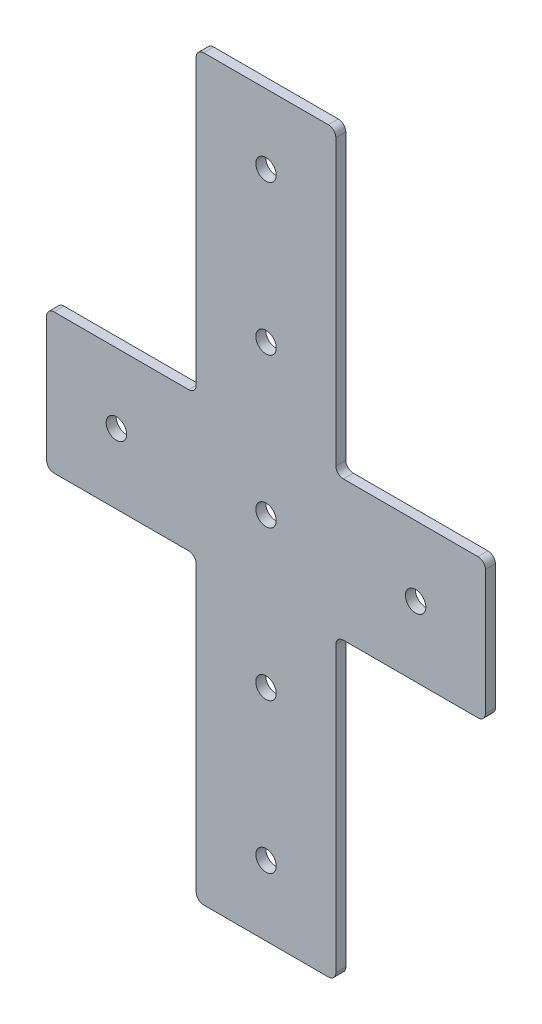
ISO-10303-21;
HEADER;
FILE_DESCRIPTION(('STEP AP214'),'2;1');
FILE_NAME('part.step','',(''),(''),'','','');
FILE_SCHEMA(('AUTOMOTIVE_DESIGN { 1 0 10303 214 1 1 1 1 }'));
ENDSEC;
DATA;
#1=APPLICATION_CONTEXT('core data for automotive mechanical design processes');
#2=APPLICATION_PROTOCOL_DEFINITION('international standard','automotive_design',2000,#1);
#3=PRODUCT_CONTEXT('',#1,'mechanical');
#4=PRODUCT('Part','Part','',(#3));
#5=PRODUCT_RELATED_PRODUCT_CATEGORY('part','',(#4));
#6=PRODUCT_DEFINITION_FORMATION('','',#4);
#7=PRODUCT_DEFINITION_CONTEXT('part definition',#1,'design');
#8=PRODUCT_DEFINITION('design','',#6,#7);
#9=PRODUCT_DEFINITION_SHAPE('','',#8);
#10=(LENGTH_UNIT() NAMED_UNIT(*) SI_UNIT(.MILLI.,.METRE.));
#11=(NAMED_UNIT(*) PLANE_ANGLE_UNIT() SI_UNIT($,.RADIAN.));
#12=(NAMED_UNIT(*) SI_UNIT($,.STERADIAN.) SOLID_ANGLE_UNIT());
#13=UNCERTAINTY_MEASURE_WITH_UNIT(LENGTH_MEASURE(1.E-05),#10,'distance_accuracy_value','');
#14=(GEOMETRIC_REPRESENTATION_CONTEXT(3) GLOBAL_UNCERTAINTY_ASSIGNED_CONTEXT((#13)) GLOBAL_UNIT_ASSIGNED_CONTEXT((#10,
#11,#12)) REPRESENTATION_CONTEXT('',''));
#15=CARTESIAN_POINT('',(0.,0.,0.));
#16=DIRECTION('',(0.,0.,1.));
#17=DIRECTION('',(1.,0.,0.));
#18=AXIS2_PLACEMENT_3D('',#15,#16,#17);
#19=CARTESIAN_POINT('',(148.,28.,4.));
#20=DIRECTION('',(-1.,0.,0.));
#21=DIRECTION('',(0.,0.,1.));
#22=AXIS2_PLACEMENT_3D('',#19,#20,#21);
#23=PLANE('',#22);
#24=DIRECTION('',(0.,1.,0.));
#25=VECTOR('',#24,1.);
#26=CARTESIAN_POINT('',(148.,28.,0.));
#27=LINE('',#26,#25);
#28=CARTESIAN_POINT('',(148.,-25.,0.));
#29=VERTEX_POINT('',#28);
#30=CARTESIAN_POINT('',(148.,25.,0.));
#31=VERTEX_POINT('',#30);
#32=EDGE_CURVE('E253',#29,#31,#27,.T.);
#33=ORIENTED_EDGE('',*,*,#32,.T.);
#34=DIRECTION('',(0.,0.,-1.));
#35=VECTOR('',#34,1.);
#36=CARTESIAN_POINT('',(148.,25.,4.));
#37=LINE('',#36,#35);
#38=CARTESIAN_POINT('',(148.,25.,4.));
#39=VERTEX_POINT('',#38);
#40=EDGE_CURVE('E381',#39,#31,#37,.T.);
#41=ORIENTED_EDGE('',*,*,#40,.F.);
#42=DIRECTION('',(0.,1.,0.));
#43=VECTOR('',#42,1.);
#44=CARTESIAN_POINT('',(148.,28.,4.));
#45=LINE('',#44,#43);
#46=CARTESIAN_POINT('',(148.,-25.,4.));
#47=VERTEX_POINT('',#46);
#48=EDGE_CURVE('E266',#47,#39,#45,.T.);
#49=ORIENTED_EDGE('',*,*,#48,.F.);
#50=DIRECTION('',(0.,0.,-1.));
#51=VECTOR('',#50,1.);
#52=CARTESIAN_POINT('',(148.,-25.,4.));
#53=LINE('',#52,#51);
#54=EDGE_CURVE('E323',#47,#29,#53,.T.);
#55=ORIENTED_EDGE('',*,*,#54,.T.);
#56=EDGE_LOOP('',(#33,#41,#49,#55));
#57=FACE_BOUND('',#56,.T.);
#58=ADVANCED_FACE('F16',(#57),#23,.F.);
#59=CARTESIAN_POINT('',(0.,0.,4.));
#60=DIRECTION('',(0.,0.,1.));
#61=DIRECTION('',(1.,0.,0.));
#62=AXIS2_PLACEMENT_3D('',#59,#60,#61);
#63=PLANE('',#62);
#64=CARTESIAN_POINT('',(60.,0.,4.));
#65=DIRECTION('',(0.,0.,1.));
#66=DIRECTION('',(1.,0.,0.));
#67=AXIS2_PLACEMENT_3D('',#64,#65,#66);
#68=CIRCLE('',#67,4.09999999999999);
#69=CARTESIAN_POINT('',(64.1,0.,4.));
#70=VERTEX_POINT('',#69);
#71=EDGE_CURVE('E238',#70,#70,#68,.T.);
#72=ORIENTED_EDGE('',*,*,#71,.F.);
#73=EDGE_LOOP('',(#72));
#74=FACE_BOUND('',#73,.T.);
#75=CARTESIAN_POINT('',(120.,0.,4.));
#76=DIRECTION('',(0.,0.,1.));
#77=DIRECTION('',(1.,0.,0.));
#78=AXIS2_PLACEMENT_3D('',#75,#76,#77);
#79=CIRCLE('',#78,4.1);
#80=CARTESIAN_POINT('',(124.1,0.,4.));
#81=VERTEX_POINT('',#80);
#82=EDGE_CURVE('E232',#81,#81,#79,.T.);
#83=ORIENTED_EDGE('',*,*,#82,.F.);
#84=EDGE_LOOP('',(#83));
#85=FACE_BOUND('',#84,.T.);
#86=CARTESIAN_POINT('',(0.,0.,4.));
#87=DIRECTION('',(0.,0.,1.));
#88=DIRECTION('',(1.,0.,0.));
#89=AXIS2_PLACEMENT_3D('',#86,#87,#88);
#90=CIRCLE('',#89,4.1);
#91=CARTESIAN_POINT('',(4.1,0.,4.));
#92=VERTEX_POINT('',#91);
#93=EDGE_CURVE('E244',#92,#92,#90,.T.);
#94=ORIENTED_EDGE('',*,*,#93,.F.);
#95=EDGE_LOOP('',(#94));
#96=FACE_BOUND('',#95,.T.);
#97=CARTESIAN_POINT('',(60.0000000000006,-120.,4.));
#98=DIRECTION('',(0.,0.,1.));
#99=DIRECTION('',(1.,0.,0.));
#100=AXIS2_PLACEMENT_3D('',#97,#98,#99);
#101=CIRCLE('',#100,4.1);
#102=CARTESIAN_POINT('',(64.1000000000006,-120.,4.));
#103=VERTEX_POINT('',#102);
#104=EDGE_CURVE('E226',#103,#103,#101,.T.);
#105=ORIENTED_EDGE('',*,*,#104,.F.);
#106=EDGE_LOOP('',(#105));
#107=FACE_BOUND('',#106,.T.);
#108=CARTESIAN_POINT('',(60.,-60.,4.));
#109=DIRECTION('',(0.,0.,1.));
#110=DIRECTION('',(1.,0.,0.));
#111=AXIS2_PLACEMENT_3D('',#108,#109,#110);
#112=CIRCLE('',#111,4.09999999999999);
#113=CARTESIAN_POINT('',(64.1,-60.,4.));
#114=VERTEX_POINT('',#113);
#115=EDGE_CURVE('E220',#114,#114,#112,.T.);
#116=ORIENTED_EDGE('',*,*,#115,.F.);
#117=EDGE_LOOP('',(#116));
#118=FACE_BOUND('',#117,.T.);
#119=ORIENTED_EDGE('',*,*,#48,.T.);
#120=CARTESIAN_POINT('',(145.,25.,4.));
#121=DIRECTION('',(0.,0.,-1.));
#122=DIRECTION('',(1.,0.,0.));
#123=AXIS2_PLACEMENT_3D('',#120,#121,#122);
#124=CIRCLE('',#123,3.);
#125=CARTESIAN_POINT('',(145.,28.,4.));
#126=VERTEX_POINT('',#125);
#127=EDGE_CURVE('E384',#126,#39,#124,.T.);
#128=ORIENTED_EDGE('',*,*,#127,.F.);
#129=DIRECTION('',(1.,0.,0.));
#130=VECTOR('',#129,1.);
#131=CARTESIAN_POINT('',(88.,28.,4.));
#132=LINE('',#131,#130);
#133=CARTESIAN_POINT('',(91.,28.,4.));
#134=VERTEX_POINT('',#133);
#135=EDGE_CURVE('E419',#134,#126,#132,.T.);
#136=ORIENTED_EDGE('',*,*,#135,.F.);
#137=CARTESIAN_POINT('',(91.,31.,4.));
#138=DIRECTION('',(0.,0.,-1.));
#139=DIRECTION('',(1.,0.,0.));
#140=AXIS2_PLACEMENT_3D('',#137,#138,#139);
#141=CIRCLE('',#140,3.);
#142=CARTESIAN_POINT('',(88.,31.,4.));
#143=VERTEX_POINT('',#142);
#144=EDGE_CURVE('E186',#143,#134,#141,.F.);
#145=ORIENTED_EDGE('',*,*,#144,.F.);
#146=DIRECTION('',(0.,-1.,0.));
#147=VECTOR('',#146,1.);
#148=CARTESIAN_POINT('',(88.,28.,4.));
#149=LINE('',#148,#147);
#150=CARTESIAN_POINT('',(88.,145.,4.));
#151=VERTEX_POINT('',#150);
#152=EDGE_CURVE('E414',#151,#143,#149,.T.);
#153=ORIENTED_EDGE('',*,*,#152,.F.);
#154=CARTESIAN_POINT('',(85.,145.,4.));
#155=DIRECTION('',(0.,0.,-1.));
#156=DIRECTION('',(1.,0.,0.));
#157=AXIS2_PLACEMENT_3D('',#154,#155,#156);
#158=CIRCLE('',#157,3.);
#159=CARTESIAN_POINT('',(85.,148.,4.));
#160=VERTEX_POINT('',#159);
#161=EDGE_CURVE('E387',#160,#151,#158,.T.);
#162=ORIENTED_EDGE('',*,*,#161,.F.);
#163=DIRECTION('',(1.,0.,0.));
#164=VECTOR('',#163,1.);
#165=CARTESIAN_POINT('',(32.,148.,4.));
#166=LINE('',#165,#164);
#167=CARTESIAN_POINT('',(35.,148.,4.));
#168=VERTEX_POINT('',#167);
#169=EDGE_CURVE('E411',#168,#160,#166,.T.);
#170=ORIENTED_EDGE('',*,*,#169,.F.);
#171=CARTESIAN_POINT('',(35.,145.,4.));
#172=DIRECTION('',(0.,0.,-1.));
#173=DIRECTION('',(1.,0.,0.));
#174=AXIS2_PLACEMENT_3D('',#171,#172,#173);
#175=CIRCLE('',#174,3.);
#176=CARTESIAN_POINT('',(32.,145.,4.));
#177=VERTEX_POINT('',#176);
#178=EDGE_CURVE('E391',#177,#168,#175,.T.);
#179=ORIENTED_EDGE('',*,*,#178,.F.);
#180=DIRECTION('',(0.,1.,0.));
#181=VECTOR('',#180,1.);
#182=CARTESIAN_POINT('',(32.,28.,4.));
#183=LINE('',#182,#181);
#184=CARTESIAN_POINT('',(32.,31.,4.));
#185=VERTEX_POINT('',#184);
#186=EDGE_CURVE('E415',#185,#177,#183,.T.);
#187=ORIENTED_EDGE('',*,*,#186,.F.);
#188=CARTESIAN_POINT('',(29.,31.,4.));
#189=DIRECTION('',(0.,0.,-1.));
#190=DIRECTION('',(1.,0.,0.));
#191=AXIS2_PLACEMENT_3D('',#188,#189,#190);
#192=CIRCLE('',#191,3.);
#193=CARTESIAN_POINT('',(29.,28.,4.));
#194=VERTEX_POINT('',#193);
#195=EDGE_CURVE('E216',#194,#185,#192,.F.);
#196=ORIENTED_EDGE('',*,*,#195,.F.);
#197=DIRECTION('',(1.,0.,0.));
#198=VECTOR('',#197,1.);
#199=CARTESIAN_POINT('',(-28.,28.,4.));
#200=LINE('',#199,#198);
#201=CARTESIAN_POINT('',(-25.,28.,4.));
#202=VERTEX_POINT('',#201);
#203=EDGE_CURVE('E199',#202,#194,#200,.T.);
#204=ORIENTED_EDGE('',*,*,#203,.F.);
#205=CARTESIAN_POINT('',(-25.,25.,4.));
#206=DIRECTION('',(0.,0.,-1.));
#207=DIRECTION('',(1.,0.,0.));
#208=AXIS2_PLACEMENT_3D('',#205,#206,#207);
#209=CIRCLE('',#208,3.);
#210=CARTESIAN_POINT('',(-28.,25.,4.));
#211=VERTEX_POINT('',#210);
#212=EDGE_CURVE('E388',#211,#202,#209,.T.);
#213=ORIENTED_EDGE('',*,*,#212,.F.);
#214=DIRECTION('',(0.,-1.,0.));
#215=VECTOR('',#214,1.);
#216=CARTESIAN_POINT('',(-28.,28.,4.));
#217=LINE('',#216,#215);
#218=CARTESIAN_POINT('',(-28.,-25.,4.));
#219=VERTEX_POINT('',#218);
#220=EDGE_CURVE('E250',#211,#219,#217,.T.);
#221=ORIENTED_EDGE('',*,*,#220,.T.);
#222=CARTESIAN_POINT('',(-25.,-25.,4.));
#223=DIRECTION('',(0.,0.,1.));
#224=DIRECTION('',(1.,0.,0.));
#225=AXIS2_PLACEMENT_3D('',#222,#223,#224);
#226=CIRCLE('',#225,3.);
#227=CARTESIAN_POINT('',(-25.,-28.,4.));
#228=VERTEX_POINT('',#227);
#229=EDGE_CURVE('E316',#219,#228,#226,.T.);
#230=ORIENTED_EDGE('',*,*,#229,.T.);
#231=DIRECTION('',(1.,0.,0.));
#232=VECTOR('',#231,1.);
#233=CARTESIAN_POINT('',(-28.,-28.,4.));
#234=LINE('',#233,#232);
#235=CARTESIAN_POINT('',(29.,-28.,4.));
#236=VERTEX_POINT('',#235);
#237=EDGE_CURVE('E252',#228,#236,#234,.T.);
#238=ORIENTED_EDGE('',*,*,#237,.T.);
#239=CARTESIAN_POINT('',(29.,-31.,4.));
#240=DIRECTION('',(0.,0.,1.));
#241=DIRECTION('',(1.,0.,0.));
#242=AXIS2_PLACEMENT_3D('',#239,#240,#241);
#243=CIRCLE('',#242,3.);
#244=CARTESIAN_POINT('',(32.,-31.,4.));
#245=VERTEX_POINT('',#244);
#246=EDGE_CURVE('E10',#236,#245,#243,.F.);
#247=ORIENTED_EDGE('',*,*,#246,.T.);
#248=DIRECTION('',(0.,-1.,0.));
#249=VECTOR('',#248,1.);
#250=CARTESIAN_POINT('',(32.,-28.,4.));
#251=LINE('',#250,#249);
#252=CARTESIAN_POINT('',(32.,-145.,4.));
#253=VERTEX_POINT('',#252);
#254=EDGE_CURVE('E256',#245,#253,#251,.T.);
#255=ORIENTED_EDGE('',*,*,#254,.T.);
#256=CARTESIAN_POINT('',(35.,-145.,4.));
#257=DIRECTION('',(0.,0.,1.));
#258=DIRECTION('',(1.,0.,0.));
#259=AXIS2_PLACEMENT_3D('',#256,#257,#258);
#260=CIRCLE('',#259,3.);
#261=CARTESIAN_POINT('',(35.,-148.,4.));
#262=VERTEX_POINT('',#261);
#263=EDGE_CURVE('E321',#253,#262,#260,.T.);
#264=ORIENTED_EDGE('',*,*,#263,.T.);
#265=DIRECTION('',(1.,0.,0.));
#266=VECTOR('',#265,1.);
#267=CARTESIAN_POINT('',(32.,-148.,4.));
#268=LINE('',#267,#266);
#269=CARTESIAN_POINT('',(85.,-148.,4.));
#270=VERTEX_POINT('',#269);
#271=EDGE_CURVE('E259',#262,#270,#268,.T.);
#272=ORIENTED_EDGE('',*,*,#271,.T.);
#273=CARTESIAN_POINT('',(85.,-145.,4.));
#274=DIRECTION('',(0.,0.,1.));
#275=DIRECTION('',(1.,0.,0.));
#276=AXIS2_PLACEMENT_3D('',#273,#274,#275);
#277=CIRCLE('',#276,3.);
#278=CARTESIAN_POINT('',(88.,-145.,4.));
#279=VERTEX_POINT('',#278);
#280=EDGE_CURVE('E319',#270,#279,#277,.T.);
#281=ORIENTED_EDGE('',*,*,#280,.T.);
#282=DIRECTION('',(0.,1.,0.));
#283=VECTOR('',#282,1.);
#284=CARTESIAN_POINT('',(88.,-28.,4.));
#285=LINE('',#284,#283);
#286=CARTESIAN_POINT('',(88.,-31.,4.));
#287=VERTEX_POINT('',#286);
#288=EDGE_CURVE('E261',#279,#287,#285,.T.);
#289=ORIENTED_EDGE('',*,*,#288,.T.);
#290=CARTESIAN_POINT('',(91.,-31.,4.));
#291=DIRECTION('',(0.,0.,1.));
#292=DIRECTION('',(1.,0.,0.));
#293=AXIS2_PLACEMENT_3D('',#290,#291,#292);
#294=CIRCLE('',#293,3.);
#295=CARTESIAN_POINT('',(91.,-28.,4.));
#296=VERTEX_POINT('',#295);
#297=EDGE_CURVE('E332',#287,#296,#294,.F.);
#298=ORIENTED_EDGE('',*,*,#297,.T.);
#299=DIRECTION('',(1.,0.,0.));
#300=VECTOR('',#299,1.);
#301=CARTESIAN_POINT('',(88.,-28.,4.));
#302=LINE('',#301,#300);
#303=CARTESIAN_POINT('',(145.,-28.,4.));
#304=VERTEX_POINT('',#303);
#305=EDGE_CURVE('E264',#296,#304,#302,.T.);
#306=ORIENTED_EDGE('',*,*,#305,.T.);
#307=CARTESIAN_POINT('',(145.,-25.,4.));
#308=DIRECTION('',(0.,0.,1.));
#309=DIRECTION('',(1.,0.,0.));
#310=AXIS2_PLACEMENT_3D('',#307,#308,#309);
#311=CIRCLE('',#310,3.);
#312=EDGE_CURVE('E31',#304,#47,#311,.T.);
#313=ORIENTED_EDGE('',*,*,#312,.T.);
#314=EDGE_LOOP('',(#119,#128,#136,#145,#153,#162,#170,#179,#187,#196,#204,#213,#221,#230,#238,
#247,#255,#264,#272,#281,#289,#298,#306,#313));
#315=FACE_BOUND('',#314,.T.);
#316=CARTESIAN_POINT('',(60.0000000000006,120.,4.));
#317=DIRECTION('',(0.,0.,-1.));
#318=DIRECTION('',(1.,0.,0.));
#319=AXIS2_PLACEMENT_3D('',#316,#317,#318);
#320=CIRCLE('',#319,4.1);
#321=CARTESIAN_POINT('',(64.1000000000006,120.,4.));
#322=VERTEX_POINT('',#321);
#323=EDGE_CURVE('E428',#322,#322,#320,.T.);
#324=ORIENTED_EDGE('',*,*,#323,.T.);
#325=EDGE_LOOP('',(#324));
#326=FACE_BOUND('',#325,.T.);
#327=CARTESIAN_POINT('',(60.,60.,4.));
#328=DIRECTION('',(0.,0.,-1.));
#329=DIRECTION('',(1.,0.,0.));
#330=AXIS2_PLACEMENT_3D('',#327,#328,#329);
#331=CIRCLE('',#330,4.09999999999999);
#332=CARTESIAN_POINT('',(64.1,60.,4.));
#333=VERTEX_POINT('',#332);
#334=EDGE_CURVE('E471',#333,#333,#331,.T.);
#335=ORIENTED_EDGE('',*,*,#334,.T.);
#336=EDGE_LOOP('',(#335));
#337=FACE_BOUND('',#336,.T.);
#338=ADVANCED_FACE('F345',(#74,#85,#96,#107,#118,#315,#326,#337),#63,.T.);
#339=CARTESIAN_POINT('',(0.,0.,0.));
#340=DIRECTION('',(0.,0.,1.));
#341=DIRECTION('',(1.,0.,0.));
#342=AXIS2_PLACEMENT_3D('',#339,#340,#341);
#343=PLANE('',#342);
#344=CARTESIAN_POINT('',(60.,0.,0.));
#345=DIRECTION('',(0.,0.,1.));
#346=DIRECTION('',(1.,0.,0.));
#347=AXIS2_PLACEMENT_3D('',#344,#345,#346);
#348=CIRCLE('',#347,4.09999999999999);
#349=CARTESIAN_POINT('',(64.1,0.,0.));
#350=VERTEX_POINT('',#349);
#351=EDGE_CURVE('E235',#350,#350,#348,.T.);
#352=ORIENTED_EDGE('',*,*,#351,.T.);
#353=EDGE_LOOP('',(#352));
#354=FACE_BOUND('',#353,.T.);
#355=CARTESIAN_POINT('',(120.,0.,0.));
#356=DIRECTION('',(0.,0.,1.));
#357=DIRECTION('',(1.,0.,0.));
#358=AXIS2_PLACEMENT_3D('',#355,#356,#357);
#359=CIRCLE('',#358,4.1);
#360=CARTESIAN_POINT('',(124.1,0.,0.));
#361=VERTEX_POINT('',#360);
#362=EDGE_CURVE('E229',#361,#361,#359,.T.);
#363=ORIENTED_EDGE('',*,*,#362,.T.);
#364=EDGE_LOOP('',(#363));
#365=FACE_BOUND('',#364,.T.);
#366=CARTESIAN_POINT('',(0.,0.,0.));
#367=DIRECTION('',(0.,0.,1.));
#368=DIRECTION('',(1.,0.,0.));
#369=AXIS2_PLACEMENT_3D('',#366,#367,#368);
#370=CIRCLE('',#369,4.1);
#371=CARTESIAN_POINT('',(4.1,0.,0.));
#372=VERTEX_POINT('',#371);
#373=EDGE_CURVE('E241',#372,#372,#370,.T.);
#374=ORIENTED_EDGE('',*,*,#373,.T.);
#375=EDGE_LOOP('',(#374));
#376=FACE_BOUND('',#375,.T.);
#377=CARTESIAN_POINT('',(60.,-60.,0.));
#378=DIRECTION('',(0.,0.,1.));
#379=DIRECTION('',(1.,0.,0.));
#380=AXIS2_PLACEMENT_3D('',#377,#378,#379);
#381=CIRCLE('',#380,4.09999999999999);
#382=CARTESIAN_POINT('',(64.1,-60.,0.));
#383=VERTEX_POINT('',#382);
#384=EDGE_CURVE('E219',#383,#383,#381,.T.);
#385=ORIENTED_EDGE('',*,*,#384,.T.);
#386=EDGE_LOOP('',(#385));
#387=FACE_BOUND('',#386,.T.);
#388=CARTESIAN_POINT('',(60.0000000000006,-120.,0.));
#389=DIRECTION('',(0.,0.,1.));
#390=DIRECTION('',(1.,0.,0.));
#391=AXIS2_PLACEMENT_3D('',#388,#389,#390);
#392=CIRCLE('',#391,4.1);
#393=CARTESIAN_POINT('',(64.1000000000006,-120.,0.));
#394=VERTEX_POINT('',#393);
#395=EDGE_CURVE('E223',#394,#394,#392,.T.);
#396=ORIENTED_EDGE('',*,*,#395,.T.);
#397=EDGE_LOOP('',(#396));
#398=FACE_BOUND('',#397,.T.);
#399=CARTESIAN_POINT('',(145.,25.,0.));
#400=DIRECTION('',(0.,0.,-1.));
#401=DIRECTION('',(1.,0.,0.));
#402=AXIS2_PLACEMENT_3D('',#399,#400,#401);
#403=CIRCLE('',#402,3.);
#404=CARTESIAN_POINT('',(145.,28.,0.));
#405=VERTEX_POINT('',#404);
#406=EDGE_CURVE('E452',#31,#405,#403,.F.);
#407=ORIENTED_EDGE('',*,*,#406,.F.);
#408=ORIENTED_EDGE('',*,*,#32,.F.);
#409=CARTESIAN_POINT('',(145.,-25.,0.));
#410=DIRECTION('',(0.,0.,1.));
#411=DIRECTION('',(1.,0.,0.));
#412=AXIS2_PLACEMENT_3D('',#409,#410,#411);
#413=CIRCLE('',#412,3.);
#414=CARTESIAN_POINT('',(145.,-28.,0.));
#415=VERTEX_POINT('',#414);
#416=EDGE_CURVE('E310',#29,#415,#413,.F.);
#417=ORIENTED_EDGE('',*,*,#416,.T.);
#418=DIRECTION('',(1.,0.,0.));
#419=VECTOR('',#418,1.);
#420=CARTESIAN_POINT('',(88.,-28.,0.));
#421=LINE('',#420,#419);
#422=CARTESIAN_POINT('',(91.,-28.,0.));
#423=VERTEX_POINT('',#422);
#424=EDGE_CURVE('E281',#423,#415,#421,.T.);
#425=ORIENTED_EDGE('',*,*,#424,.F.);
#426=CARTESIAN_POINT('',(91.,-31.,0.));
#427=DIRECTION('',(0.,0.,1.));
#428=DIRECTION('',(1.,0.,0.));
#429=AXIS2_PLACEMENT_3D('',#426,#427,#428);
#430=CIRCLE('',#429,3.);
#431=CARTESIAN_POINT('',(88.,-31.,0.));
#432=VERTEX_POINT('',#431);
#433=EDGE_CURVE('E330',#423,#432,#430,.T.);
#434=ORIENTED_EDGE('',*,*,#433,.T.);
#435=DIRECTION('',(0.,1.,0.));
#436=VECTOR('',#435,1.);
#437=CARTESIAN_POINT('',(88.,-28.,0.));
#438=LINE('',#437,#436);
#439=CARTESIAN_POINT('',(88.,-145.,0.));
#440=VERTEX_POINT('',#439);
#441=EDGE_CURVE('E278',#440,#432,#438,.T.);
#442=ORIENTED_EDGE('',*,*,#441,.F.);
#443=CARTESIAN_POINT('',(85.,-145.,0.));
#444=DIRECTION('',(0.,0.,1.));
#445=DIRECTION('',(1.,0.,0.));
#446=AXIS2_PLACEMENT_3D('',#443,#444,#445);
#447=CIRCLE('',#446,3.);
#448=CARTESIAN_POINT('',(85.,-148.,0.));
#449=VERTEX_POINT('',#448);
#450=EDGE_CURVE('E312',#440,#449,#447,.F.);
#451=ORIENTED_EDGE('',*,*,#450,.T.);
#452=DIRECTION('',(1.,0.,0.));
#453=VECTOR('',#452,1.);
#454=CARTESIAN_POINT('',(32.,-148.,0.));
#455=LINE('',#454,#453);
#456=CARTESIAN_POINT('',(35.,-148.,0.));
#457=VERTEX_POINT('',#456);
#458=EDGE_CURVE('E276',#457,#449,#455,.T.);
#459=ORIENTED_EDGE('',*,*,#458,.F.);
#460=CARTESIAN_POINT('',(35.,-145.,0.));
#461=DIRECTION('',(0.,0.,1.));
#462=DIRECTION('',(1.,0.,0.));
#463=AXIS2_PLACEMENT_3D('',#460,#461,#462);
#464=CIRCLE('',#463,3.);
#465=CARTESIAN_POINT('',(32.,-145.,0.));
#466=VERTEX_POINT('',#465);
#467=EDGE_CURVE('E314',#457,#466,#464,.F.);
#468=ORIENTED_EDGE('',*,*,#467,.T.);
#469=DIRECTION('',(0.,-1.,0.));
#470=VECTOR('',#469,1.);
#471=CARTESIAN_POINT('',(32.,-28.,0.));
#472=LINE('',#471,#470);
#473=CARTESIAN_POINT('',(32.,-31.,0.));
#474=VERTEX_POINT('',#473);
#475=EDGE_CURVE('E273',#474,#466,#472,.T.);
#476=ORIENTED_EDGE('',*,*,#475,.F.);
#477=CARTESIAN_POINT('',(29.,-31.,0.));
#478=DIRECTION('',(0.,0.,1.));
#479=DIRECTION('',(1.,0.,0.));
#480=AXIS2_PLACEMENT_3D('',#477,#478,#479);
#481=CIRCLE('',#480,3.);
#482=CARTESIAN_POINT('',(29.,-28.,0.));
#483=VERTEX_POINT('',#482);
#484=EDGE_CURVE('E24',#474,#483,#481,.T.);
#485=ORIENTED_EDGE('',*,*,#484,.T.);
#486=DIRECTION('',(1.,0.,0.));
#487=VECTOR('',#486,1.);
#488=CARTESIAN_POINT('',(-28.,-28.,0.));
#489=LINE('',#488,#487);
#490=CARTESIAN_POINT('',(-25.,-28.,0.));
#491=VERTEX_POINT('',#490);
#492=EDGE_CURVE('E270',#491,#483,#489,.T.);
#493=ORIENTED_EDGE('',*,*,#492,.F.);
#494=CARTESIAN_POINT('',(-25.,-25.,0.));
#495=DIRECTION('',(0.,0.,1.));
#496=DIRECTION('',(1.,0.,0.));
#497=AXIS2_PLACEMENT_3D('',#494,#495,#496);
#498=CIRCLE('',#497,3.);
#499=CARTESIAN_POINT('',(-28.,-25.,0.));
#500=VERTEX_POINT('',#499);
#501=EDGE_CURVE('E307',#491,#500,#498,.F.);
#502=ORIENTED_EDGE('',*,*,#501,.T.);
#503=DIRECTION('',(0.,-1.,0.));
#504=VECTOR('',#503,1.);
#505=CARTESIAN_POINT('',(-28.,28.,0.));
#506=LINE('',#505,#504);
#507=CARTESIAN_POINT('',(-28.,25.,0.));
#508=VERTEX_POINT('',#507);
#509=EDGE_CURVE('E247',#508,#500,#506,.T.);
#510=ORIENTED_EDGE('',*,*,#509,.F.);
#511=CARTESIAN_POINT('',(-25.,25.,0.));
#512=DIRECTION('',(0.,0.,-1.));
#513=DIRECTION('',(1.,0.,0.));
#514=AXIS2_PLACEMENT_3D('',#511,#512,#513);
#515=CIRCLE('',#514,3.);
#516=CARTESIAN_POINT('',(-25.,28.,0.));
#517=VERTEX_POINT('',#516);
#518=EDGE_CURVE('E449',#517,#508,#515,.F.);
#519=ORIENTED_EDGE('',*,*,#518,.F.);
#520=DIRECTION('',(1.,0.,0.));
#521=VECTOR('',#520,1.);
#522=CARTESIAN_POINT('',(-28.,28.,0.));
#523=LINE('',#522,#521);
#524=CARTESIAN_POINT('',(29.,28.,0.));
#525=VERTEX_POINT('',#524);
#526=EDGE_CURVE('E424',#517,#525,#523,.T.);
#527=ORIENTED_EDGE('',*,*,#526,.T.);
#528=CARTESIAN_POINT('',(29.,31.,0.));
#529=DIRECTION('',(0.,0.,-1.));
#530=DIRECTION('',(1.,0.,0.));
#531=AXIS2_PLACEMENT_3D('',#528,#529,#530);
#532=CIRCLE('',#531,3.);
#533=CARTESIAN_POINT('',(32.,31.,0.));
#534=VERTEX_POINT('',#533);
#535=EDGE_CURVE('E208',#534,#525,#532,.T.);
#536=ORIENTED_EDGE('',*,*,#535,.F.);
#537=DIRECTION('',(0.,1.,0.));
#538=VECTOR('',#537,1.);
#539=CARTESIAN_POINT('',(32.,28.,0.));
#540=LINE('',#539,#538);
#541=CARTESIAN_POINT('',(32.,145.,0.));
#542=VERTEX_POINT('',#541);
#543=EDGE_CURVE('E427',#534,#542,#540,.T.);
#544=ORIENTED_EDGE('',*,*,#543,.T.);
#545=CARTESIAN_POINT('',(35.,145.,0.));
#546=DIRECTION('',(0.,0.,-1.));
#547=DIRECTION('',(1.,0.,0.));
#548=AXIS2_PLACEMENT_3D('',#545,#546,#547);
#549=CIRCLE('',#548,3.);
#550=CARTESIAN_POINT('',(35.,148.,0.));
#551=VERTEX_POINT('',#550);
#552=EDGE_CURVE('E394',#551,#542,#549,.F.);
#553=ORIENTED_EDGE('',*,*,#552,.F.);
#554=DIRECTION('',(1.,0.,0.));
#555=VECTOR('',#554,1.);
#556=CARTESIAN_POINT('',(32.,148.,0.));
#557=LINE('',#556,#555);
#558=CARTESIAN_POINT('',(85.,148.,0.));
#559=VERTEX_POINT('',#558);
#560=EDGE_CURVE('E431',#551,#559,#557,.T.);
#561=ORIENTED_EDGE('',*,*,#560,.T.);
#562=CARTESIAN_POINT('',(85.,145.,0.));
#563=DIRECTION('',(0.,0.,-1.));
#564=DIRECTION('',(1.,0.,0.));
#565=AXIS2_PLACEMENT_3D('',#562,#563,#564);
#566=CIRCLE('',#565,3.);
#567=CARTESIAN_POINT('',(88.,145.,0.));
#568=VERTEX_POINT('',#567);
#569=EDGE_CURVE('E406',#568,#559,#566,.F.);
#570=ORIENTED_EDGE('',*,*,#569,.F.);
#571=DIRECTION('',(0.,-1.,0.));
#572=VECTOR('',#571,1.);
#573=CARTESIAN_POINT('',(88.,28.,0.));
#574=LINE('',#573,#572);
#575=CARTESIAN_POINT('',(88.,31.,0.));
#576=VERTEX_POINT('',#575);
#577=EDGE_CURVE('E200',#568,#576,#574,.T.);
#578=ORIENTED_EDGE('',*,*,#577,.T.);
#579=CARTESIAN_POINT('',(91.,31.,0.));
#580=DIRECTION('',(0.,0.,-1.));
#581=DIRECTION('',(1.,0.,0.));
#582=AXIS2_PLACEMENT_3D('',#579,#580,#581);
#583=CIRCLE('',#582,3.);
#584=CARTESIAN_POINT('',(91.,28.,0.));
#585=VERTEX_POINT('',#584);
#586=EDGE_CURVE('E183',#585,#576,#583,.T.);
#587=ORIENTED_EDGE('',*,*,#586,.F.);
#588=DIRECTION('',(1.,0.,0.));
#589=VECTOR('',#588,1.);
#590=CARTESIAN_POINT('',(88.,28.,0.));
#591=LINE('',#590,#589);
#592=EDGE_CURVE('E194',#585,#405,#591,.T.);
#593=ORIENTED_EDGE('',*,*,#592,.T.);
#594=EDGE_LOOP('',(#407,#408,#417,#425,#434,#442,#451,#459,#468,#476,#485,#493,#502,#510,#519,
#527,#536,#544,#553,#561,#570,#578,#587,#593));
#595=FACE_BOUND('',#594,.T.);
#596=CARTESIAN_POINT('',(60.,60.,0.));
#597=DIRECTION('',(0.,0.,-1.));
#598=DIRECTION('',(1.,0.,0.));
#599=AXIS2_PLACEMENT_3D('',#596,#597,#598);
#600=CIRCLE('',#599,4.09999999999999);
#601=CARTESIAN_POINT('',(64.1,60.,0.));
#602=VERTEX_POINT('',#601);
#603=EDGE_CURVE('E474',#602,#602,#600,.T.);
#604=ORIENTED_EDGE('',*,*,#603,.F.);
#605=EDGE_LOOP('',(#604));
#606=FACE_BOUND('',#605,.T.);
#607=CARTESIAN_POINT('',(60.0000000000006,120.,0.));
#608=DIRECTION('',(0.,0.,-1.));
#609=DIRECTION('',(1.,0.,0.));
#610=AXIS2_PLACEMENT_3D('',#607,#608,#609);
#611=CIRCLE('',#610,4.1);
#612=CARTESIAN_POINT('',(64.1000000000006,120.,0.));
#613=VERTEX_POINT('',#612);
#614=EDGE_CURVE('E468',#613,#613,#611,.T.);
#615=ORIENTED_EDGE('',*,*,#614,.F.);
#616=EDGE_LOOP('',(#615));
#617=FACE_BOUND('',#616,.T.);
#618=ADVANCED_FACE('F202',(#354,#365,#376,#387,#398,#595,#606,#617),#343,.F.);
#619=CARTESIAN_POINT('',(0.,0.,4.));
#620=DIRECTION('',(0.,0.,-1.));
#621=DIRECTION('',(-1.,0.,0.));
#622=AXIS2_PLACEMENT_3D('',#619,#620,#621);
#623=CYLINDRICAL_SURFACE('',#622,4.1);
#624=ORIENTED_EDGE('',*,*,#373,.F.);
#625=EDGE_LOOP('',(#624));
#626=FACE_BOUND('',#625,.T.);
#627=ORIENTED_EDGE('',*,*,#93,.T.);
#628=EDGE_LOOP('',(#627));
#629=FACE_BOUND('',#628,.T.);
#630=ADVANCED_FACE('F489',(#626,#629),#623,.F.);
#631=CARTESIAN_POINT('',(60.,0.,4.));
#632=DIRECTION('',(0.,0.,-1.));
#633=DIRECTION('',(-1.,0.,0.));
#634=AXIS2_PLACEMENT_3D('',#631,#632,#633);
#635=CYLINDRICAL_SURFACE('',#634,4.09999999999999);
#636=ORIENTED_EDGE('',*,*,#351,.F.);
#637=EDGE_LOOP('',(#636));
#638=FACE_BOUND('',#637,.T.);
#639=ORIENTED_EDGE('',*,*,#71,.T.);
#640=EDGE_LOOP('',(#639));
#641=FACE_BOUND('',#640,.T.);
#642=ADVANCED_FACE('F581',(#638,#641),#635,.F.);
#643=CARTESIAN_POINT('',(120.,0.,4.));
#644=DIRECTION('',(0.,0.,-1.));
#645=DIRECTION('',(-1.,0.,0.));
#646=AXIS2_PLACEMENT_3D('',#643,#644,#645);
#647=CYLINDRICAL_SURFACE('',#646,4.1);
#648=ORIENTED_EDGE('',*,*,#82,.T.);
#649=EDGE_LOOP('',(#648));
#650=FACE_BOUND('',#649,.T.);
#651=ORIENTED_EDGE('',*,*,#362,.F.);
#652=EDGE_LOOP('',(#651));
#653=FACE_BOUND('',#652,.T.);
#654=ADVANCED_FACE('F526',(#650,#653),#647,.F.);
#655=CARTESIAN_POINT('',(-28.,28.,4.));
#656=DIRECTION('',(1.,0.,0.));
#657=DIRECTION('',(0.,1.,0.));
#658=AXIS2_PLACEMENT_3D('',#655,#656,#657);
#659=PLANE('',#658);
#660=ORIENTED_EDGE('',*,*,#220,.F.);
#661=DIRECTION('',(0.,0.,-1.));
#662=VECTOR('',#661,1.);
#663=CARTESIAN_POINT('',(-28.,25.,4.));
#664=LINE('',#663,#662);
#665=EDGE_CURVE('E446',#508,#211,#664,.F.);
#666=ORIENTED_EDGE('',*,*,#665,.F.);
#667=ORIENTED_EDGE('',*,*,#509,.T.);
#668=DIRECTION('',(0.,0.,-1.));
#669=VECTOR('',#668,1.);
#670=CARTESIAN_POINT('',(-28.,-25.,4.));
#671=LINE('',#670,#669);
#672=EDGE_CURVE('E304',#500,#219,#671,.F.);
#673=ORIENTED_EDGE('',*,*,#672,.T.);
#674=EDGE_LOOP('',(#660,#666,#667,#673));
#675=FACE_BOUND('',#674,.T.);
#676=ADVANCED_FACE('F523',(#675),#659,.F.);
#677=CARTESIAN_POINT('',(-28.,-28.,4.));
#678=DIRECTION('',(0.,1.,0.));
#679=DIRECTION('',(0.,0.,1.));
#680=AXIS2_PLACEMENT_3D('',#677,#678,#679);
#681=PLANE('',#680);
#682=ORIENTED_EDGE('',*,*,#492,.T.);
#683=DIRECTION('',(0.,0.,-1.));
#684=VECTOR('',#683,1.);
#685=CARTESIAN_POINT('',(29.,-28.,4.));
#686=LINE('',#685,#684);
#687=EDGE_CURVE('E302',#483,#236,#686,.F.);
#688=ORIENTED_EDGE('',*,*,#687,.T.);
#689=ORIENTED_EDGE('',*,*,#237,.F.);
#690=DIRECTION('',(0.,0.,-1.));
#691=VECTOR('',#690,1.);
#692=CARTESIAN_POINT('',(-25.,-28.,4.));
#693=LINE('',#692,#691);
#694=EDGE_CURVE('E299',#228,#491,#693,.T.);
#695=ORIENTED_EDGE('',*,*,#694,.T.);
#696=EDGE_LOOP('',(#682,#688,#689,#695));
#697=FACE_BOUND('',#696,.T.);
#698=ADVANCED_FACE('F339',(#697),#681,.F.);
#699=CARTESIAN_POINT('',(32.,-28.,4.));
#700=DIRECTION('',(1.,0.,0.));
#701=DIRECTION('',(0.,1.,0.));
#702=AXIS2_PLACEMENT_3D('',#699,#700,#701);
#703=PLANE('',#702);
#704=ORIENTED_EDGE('',*,*,#254,.F.);
#705=DIRECTION('',(0.,0.,-1.));
#706=VECTOR('',#705,1.);
#707=CARTESIAN_POINT('',(32.,-31.,0.));
#708=LINE('',#707,#706);
#709=EDGE_CURVE('E296',#245,#474,#708,.T.);
#710=ORIENTED_EDGE('',*,*,#709,.T.);
#711=ORIENTED_EDGE('',*,*,#475,.T.);
#712=DIRECTION('',(0.,0.,-1.));
#713=VECTOR('',#712,1.);
#714=CARTESIAN_POINT('',(32.,-145.,4.));
#715=LINE('',#714,#713);
#716=EDGE_CURVE('E294',#466,#253,#715,.F.);
#717=ORIENTED_EDGE('',*,*,#716,.T.);
#718=EDGE_LOOP('',(#704,#710,#711,#717));
#719=FACE_BOUND('',#718,.T.);
#720=ADVANCED_FACE('F349',(#719),#703,.F.);
#721=CARTESIAN_POINT('',(32.,-148.,4.));
#722=DIRECTION('',(0.,1.,0.));
#723=DIRECTION('',(0.,0.,1.));
#724=AXIS2_PLACEMENT_3D('',#721,#722,#723);
#725=PLANE('',#724);
#726=ORIENTED_EDGE('',*,*,#271,.F.);
#727=DIRECTION('',(0.,0.,-1.));
#728=VECTOR('',#727,1.);
#729=CARTESIAN_POINT('',(35.,-148.,4.));
#730=LINE('',#729,#728);
#731=EDGE_CURVE('E327',#262,#457,#730,.T.);
#732=ORIENTED_EDGE('',*,*,#731,.T.);
#733=ORIENTED_EDGE('',*,*,#458,.T.);
#734=DIRECTION('',(0.,0.,-1.));
#735=VECTOR('',#734,1.);
#736=CARTESIAN_POINT('',(85.,-148.,4.));
#737=LINE('',#736,#735);
#738=EDGE_CURVE('E39',#449,#270,#737,.F.);
#739=ORIENTED_EDGE('',*,*,#738,.T.);
#740=EDGE_LOOP('',(#726,#732,#733,#739));
#741=FACE_BOUND('',#740,.T.);
#742=ADVANCED_FACE('F355',(#741),#725,.F.);
#743=CARTESIAN_POINT('',(88.,-28.,4.));
#744=DIRECTION('',(-1.,0.,0.));
#745=DIRECTION('',(0.,-1.,0.));
#746=AXIS2_PLACEMENT_3D('',#743,#744,#745);
#747=PLANE('',#746);
#748=ORIENTED_EDGE('',*,*,#441,.T.);
#749=DIRECTION('',(0.,0.,-1.));
#750=VECTOR('',#749,1.);
#751=CARTESIAN_POINT('',(88.,-31.,4.));
#752=LINE('',#751,#750);
#753=EDGE_CURVE('E292',#432,#287,#752,.F.);
#754=ORIENTED_EDGE('',*,*,#753,.T.);
#755=ORIENTED_EDGE('',*,*,#288,.F.);
#756=DIRECTION('',(0.,0.,-1.));
#757=VECTOR('',#756,1.);
#758=CARTESIAN_POINT('',(88.,-145.,4.));
#759=LINE('',#758,#757);
#760=EDGE_CURVE('E289',#279,#440,#759,.T.);
#761=ORIENTED_EDGE('',*,*,#760,.T.);
#762=EDGE_LOOP('',(#748,#754,#755,#761));
#763=FACE_BOUND('',#762,.T.);
#764=ADVANCED_FACE('F363',(#763),#747,.F.);
#765=CARTESIAN_POINT('',(88.,-28.,4.));
#766=DIRECTION('',(0.,1.,0.));
#767=DIRECTION('',(-1.,0.,0.));
#768=AXIS2_PLACEMENT_3D('',#765,#766,#767);
#769=PLANE('',#768);
#770=ORIENTED_EDGE('',*,*,#305,.F.);
#771=DIRECTION('',(0.,0.,-1.));
#772=VECTOR('',#771,1.);
#773=CARTESIAN_POINT('',(91.,-28.,0.));
#774=LINE('',#773,#772);
#775=EDGE_CURVE('E286',#296,#423,#774,.T.);
#776=ORIENTED_EDGE('',*,*,#775,.T.);
#777=ORIENTED_EDGE('',*,*,#424,.T.);
#778=DIRECTION('',(0.,0.,-1.));
#779=VECTOR('',#778,1.);
#780=CARTESIAN_POINT('',(145.,-28.,4.));
#781=LINE('',#780,#779);
#782=EDGE_CURVE('E268',#415,#304,#781,.F.);
#783=ORIENTED_EDGE('',*,*,#782,.T.);
#784=EDGE_LOOP('',(#770,#776,#777,#783));
#785=FACE_BOUND('',#784,.T.);
#786=ADVANCED_FACE('F372',(#785),#769,.F.);
#787=CARTESIAN_POINT('',(60.0000000000006,-120.,4.));
#788=DIRECTION('',(0.,0.,-1.));
#789=DIRECTION('',(-1.,0.,0.));
#790=AXIS2_PLACEMENT_3D('',#787,#788,#789);
#791=CYLINDRICAL_SURFACE('',#790,4.1);
#792=ORIENTED_EDGE('',*,*,#104,.T.);
#793=EDGE_LOOP('',(#792));
#794=FACE_BOUND('',#793,.T.);
#795=ORIENTED_EDGE('',*,*,#395,.F.);
#796=EDGE_LOOP('',(#795));
#797=FACE_BOUND('',#796,.T.);
#798=ADVANCED_FACE('F514',(#794,#797),#791,.F.);
#799=CARTESIAN_POINT('',(60.,-60.,4.));
#800=DIRECTION('',(0.,0.,-1.));
#801=DIRECTION('',(-1.,0.,0.));
#802=AXIS2_PLACEMENT_3D('',#799,#800,#801);
#803=CYLINDRICAL_SURFACE('',#802,4.09999999999999);
#804=ORIENTED_EDGE('',*,*,#115,.T.);
#805=EDGE_LOOP('',(#804));
#806=FACE_BOUND('',#805,.T.);
#807=ORIENTED_EDGE('',*,*,#384,.F.);
#808=EDGE_LOOP('',(#807));
#809=FACE_BOUND('',#808,.T.);
#810=ADVANCED_FACE('F530',(#806,#809),#803,.F.);
#811=CARTESIAN_POINT('',(91.,-31.,4.));
#812=DIRECTION('',(0.,0.,1.));
#813=DIRECTION('',(1.,0.,0.));
#814=AXIS2_PLACEMENT_3D('',#811,#812,#813);
#815=CYLINDRICAL_SURFACE('',#814,3.);
#816=ORIENTED_EDGE('',*,*,#297,.F.);
#817=ORIENTED_EDGE('',*,*,#753,.F.);
#818=ORIENTED_EDGE('',*,*,#433,.F.);
#819=ORIENTED_EDGE('',*,*,#775,.F.);
#820=EDGE_LOOP('',(#816,#817,#818,#819));
#821=FACE_BOUND('',#820,.T.);
#822=ADVANCED_FACE('F369',(#821),#815,.F.);
#823=CARTESIAN_POINT('',(29.,-31.,4.));
#824=DIRECTION('',(0.,0.,1.));
#825=DIRECTION('',(1.,0.,0.));
#826=AXIS2_PLACEMENT_3D('',#823,#824,#825);
#827=CYLINDRICAL_SURFACE('',#826,3.);
#828=ORIENTED_EDGE('',*,*,#246,.F.);
#829=ORIENTED_EDGE('',*,*,#687,.F.);
#830=ORIENTED_EDGE('',*,*,#484,.F.);
#831=ORIENTED_EDGE('',*,*,#709,.F.);
#832=EDGE_LOOP('',(#828,#829,#830,#831));
#833=FACE_BOUND('',#832,.T.);
#834=ADVANCED_FACE('F343',(#833),#827,.F.);
#835=CARTESIAN_POINT('',(35.,-145.,4.));
#836=DIRECTION('',(0.,0.,-1.));
#837=DIRECTION('',(-1.,0.,0.));
#838=AXIS2_PLACEMENT_3D('',#835,#836,#837);
#839=CYLINDRICAL_SURFACE('',#838,3.);
#840=ORIENTED_EDGE('',*,*,#263,.F.);
#841=ORIENTED_EDGE('',*,*,#716,.F.);
#842=ORIENTED_EDGE('',*,*,#467,.F.);
#843=ORIENTED_EDGE('',*,*,#731,.F.);
#844=EDGE_LOOP('',(#840,#841,#842,#843));
#845=FACE_BOUND('',#844,.T.);
#846=ADVANCED_FACE('F352',(#845),#839,.T.);
#847=CARTESIAN_POINT('',(85.,-145.,4.));
#848=DIRECTION('',(0.,0.,-1.));
#849=DIRECTION('',(-1.,0.,0.));
#850=AXIS2_PLACEMENT_3D('',#847,#848,#849);
#851=CYLINDRICAL_SURFACE('',#850,3.);
#852=ORIENTED_EDGE('',*,*,#280,.F.);
#853=ORIENTED_EDGE('',*,*,#738,.F.);
#854=ORIENTED_EDGE('',*,*,#450,.F.);
#855=ORIENTED_EDGE('',*,*,#760,.F.);
#856=EDGE_LOOP('',(#852,#853,#854,#855));
#857=FACE_BOUND('',#856,.T.);
#858=ADVANCED_FACE('F360',(#857),#851,.T.);
#859=CARTESIAN_POINT('',(145.,-25.,4.));
#860=DIRECTION('',(0.,0.,-1.));
#861=DIRECTION('',(-1.,0.,0.));
#862=AXIS2_PLACEMENT_3D('',#859,#860,#861);
#863=CYLINDRICAL_SURFACE('',#862,3.);
#864=ORIENTED_EDGE('',*,*,#312,.F.);
#865=ORIENTED_EDGE('',*,*,#782,.F.);
#866=ORIENTED_EDGE('',*,*,#416,.F.);
#867=ORIENTED_EDGE('',*,*,#54,.F.);
#868=EDGE_LOOP('',(#864,#865,#866,#867));
#869=FACE_BOUND('',#868,.T.);
#870=ADVANCED_FACE('F377',(#869),#863,.T.);
#871=CARTESIAN_POINT('',(-25.,-25.,4.));
#872=DIRECTION('',(0.,0.,-1.));
#873=DIRECTION('',(-1.,0.,0.));
#874=AXIS2_PLACEMENT_3D('',#871,#872,#873);
#875=CYLINDRICAL_SURFACE('',#874,3.);
#876=ORIENTED_EDGE('',*,*,#229,.F.);
#877=ORIENTED_EDGE('',*,*,#672,.F.);
#878=ORIENTED_EDGE('',*,*,#501,.F.);
#879=ORIENTED_EDGE('',*,*,#694,.F.);
#880=EDGE_LOOP('',(#876,#877,#878,#879));
#881=FACE_BOUND('',#880,.T.);
#882=ADVANCED_FACE('F18',(#881),#875,.T.);
#883=CARTESIAN_POINT('',(-28.,28.,4.));
#884=DIRECTION('',(0.,-1.,0.));
#885=DIRECTION('',(0.,0.,1.));
#886=AXIS2_PLACEMENT_3D('',#883,#884,#885);
#887=PLANE('',#886);
#888=ORIENTED_EDGE('',*,*,#526,.F.);
#889=DIRECTION('',(0.,0.,-1.));
#890=VECTOR('',#889,1.);
#891=CARTESIAN_POINT('',(-25.,28.,4.));
#892=LINE('',#891,#890);
#893=EDGE_CURVE('E442',#202,#517,#892,.T.);
#894=ORIENTED_EDGE('',*,*,#893,.F.);
#895=ORIENTED_EDGE('',*,*,#203,.T.);
#896=DIRECTION('',(0.,0.,-1.));
#897=VECTOR('',#896,1.);
#898=CARTESIAN_POINT('',(29.,28.,4.));
#899=LINE('',#898,#897);
#900=EDGE_CURVE('E444',#525,#194,#899,.F.);
#901=ORIENTED_EDGE('',*,*,#900,.F.);
#902=EDGE_LOOP('',(#888,#894,#895,#901));
#903=FACE_BOUND('',#902,.T.);
#904=ADVANCED_FACE('F540',(#903),#887,.F.);
#905=CARTESIAN_POINT('',(32.,28.,4.));
#906=DIRECTION('',(1.,0.,0.));
#907=DIRECTION('',(0.,-1.,0.));
#908=AXIS2_PLACEMENT_3D('',#905,#906,#907);
#909=PLANE('',#908);
#910=ORIENTED_EDGE('',*,*,#186,.T.);
#911=DIRECTION('',(0.,0.,-1.));
#912=VECTOR('',#911,1.);
#913=CARTESIAN_POINT('',(32.,145.,4.));
#914=LINE('',#913,#912);
#915=EDGE_CURVE('E438',#542,#177,#914,.F.);
#916=ORIENTED_EDGE('',*,*,#915,.F.);
#917=ORIENTED_EDGE('',*,*,#543,.F.);
#918=DIRECTION('',(0.,0.,-1.));
#919=VECTOR('',#918,1.);
#920=CARTESIAN_POINT('',(32.,31.,0.));
#921=LINE('',#920,#919);
#922=EDGE_CURVE('E440',#185,#534,#921,.T.);
#923=ORIENTED_EDGE('',*,*,#922,.F.);
#924=EDGE_LOOP('',(#910,#916,#917,#923));
#925=FACE_BOUND('',#924,.T.);
#926=ADVANCED_FACE('F462',(#925),#909,.F.);
#927=CARTESIAN_POINT('',(32.,148.,4.));
#928=DIRECTION('',(0.,-1.,0.));
#929=DIRECTION('',(0.,0.,1.));
#930=AXIS2_PLACEMENT_3D('',#927,#928,#929);
#931=PLANE('',#930);
#932=ORIENTED_EDGE('',*,*,#169,.T.);
#933=DIRECTION('',(0.,0.,-1.));
#934=VECTOR('',#933,1.);
#935=CARTESIAN_POINT('',(85.,148.,4.));
#936=LINE('',#935,#934);
#937=EDGE_CURVE('E210',#559,#160,#936,.F.);
#938=ORIENTED_EDGE('',*,*,#937,.F.);
#939=ORIENTED_EDGE('',*,*,#560,.F.);
#940=DIRECTION('',(0.,0.,-1.));
#941=VECTOR('',#940,1.);
#942=CARTESIAN_POINT('',(35.,148.,4.));
#943=LINE('',#942,#941);
#944=EDGE_CURVE('E206',#168,#551,#943,.T.);
#945=ORIENTED_EDGE('',*,*,#944,.F.);
#946=EDGE_LOOP('',(#932,#938,#939,#945));
#947=FACE_BOUND('',#946,.T.);
#948=ADVANCED_FACE('F412',(#947),#931,.F.);
#949=CARTESIAN_POINT('',(88.,28.,4.));
#950=DIRECTION('',(-1.,0.,0.));
#951=DIRECTION('',(0.,1.,0.));
#952=AXIS2_PLACEMENT_3D('',#949,#950,#951);
#953=PLANE('',#952);
#954=ORIENTED_EDGE('',*,*,#577,.F.);
#955=DIRECTION('',(0.,0.,-1.));
#956=VECTOR('',#955,1.);
#957=CARTESIAN_POINT('',(88.,145.,4.));
#958=LINE('',#957,#956);
#959=EDGE_CURVE('E190',#151,#568,#958,.T.);
#960=ORIENTED_EDGE('',*,*,#959,.F.);
#961=ORIENTED_EDGE('',*,*,#152,.T.);
#962=DIRECTION('',(0.,0.,-1.));
#963=VECTOR('',#962,1.);
#964=CARTESIAN_POINT('',(88.,31.,4.));
#965=LINE('',#964,#963);
#966=EDGE_CURVE('E436',#576,#143,#965,.F.);
#967=ORIENTED_EDGE('',*,*,#966,.F.);
#968=EDGE_LOOP('',(#954,#960,#961,#967));
#969=FACE_BOUND('',#968,.T.);
#970=ADVANCED_FACE('F501',(#969),#953,.F.);
#971=CARTESIAN_POINT('',(88.,28.,4.));
#972=DIRECTION('',(0.,-1.,0.));
#973=DIRECTION('',(-1.,0.,0.));
#974=AXIS2_PLACEMENT_3D('',#971,#972,#973);
#975=PLANE('',#974);
#976=ORIENTED_EDGE('',*,*,#135,.T.);
#977=DIRECTION('',(0.,0.,-1.));
#978=VECTOR('',#977,1.);
#979=CARTESIAN_POINT('',(145.,28.,4.));
#980=LINE('',#979,#978);
#981=EDGE_CURVE('E191',#405,#126,#980,.F.);
#982=ORIENTED_EDGE('',*,*,#981,.F.);
#983=ORIENTED_EDGE('',*,*,#592,.F.);
#984=DIRECTION('',(0.,0.,-1.));
#985=VECTOR('',#984,1.);
#986=CARTESIAN_POINT('',(91.,28.,0.));
#987=LINE('',#986,#985);
#988=EDGE_CURVE('E179',#134,#585,#987,.T.);
#989=ORIENTED_EDGE('',*,*,#988,.F.);
#990=EDGE_LOOP('',(#976,#982,#983,#989));
#991=FACE_BOUND('',#990,.T.);
#992=ADVANCED_FACE('F195',(#991),#975,.F.);
#993=CARTESIAN_POINT('',(60.0000000000006,120.,4.));
#994=DIRECTION('',(0.,0.,-1.));
#995=DIRECTION('',(-1.,0.,0.));
#996=AXIS2_PLACEMENT_3D('',#993,#994,#995);
#997=CYLINDRICAL_SURFACE('',#996,4.1);
#998=ORIENTED_EDGE('',*,*,#323,.F.);
#999=EDGE_LOOP('',(#998));
#1000=FACE_BOUND('',#999,.T.);
#1001=ORIENTED_EDGE('',*,*,#614,.T.);
#1002=EDGE_LOOP('',(#1001));
#1003=FACE_BOUND('',#1002,.T.);
#1004=ADVANCED_FACE('F484',(#1000,#1003),#997,.F.);
#1005=CARTESIAN_POINT('',(60.,60.,4.));
#1006=DIRECTION('',(0.,0.,-1.));
#1007=DIRECTION('',(-1.,0.,0.));
#1008=AXIS2_PLACEMENT_3D('',#1005,#1006,#1007);
#1009=CYLINDRICAL_SURFACE('',#1008,4.09999999999999);
#1010=ORIENTED_EDGE('',*,*,#334,.F.);
#1011=EDGE_LOOP('',(#1010));
#1012=FACE_BOUND('',#1011,.T.);
#1013=ORIENTED_EDGE('',*,*,#603,.T.);
#1014=EDGE_LOOP('',(#1013));
#1015=FACE_BOUND('',#1014,.T.);
#1016=ADVANCED_FACE('F481',(#1012,#1015),#1009,.F.);
#1017=CARTESIAN_POINT('',(91.,31.,4.));
#1018=DIRECTION('',(0.,0.,1.));
#1019=DIRECTION('',(1.,0.,0.));
#1020=AXIS2_PLACEMENT_3D('',#1017,#1018,#1019);
#1021=CYLINDRICAL_SURFACE('',#1020,3.);
#1022=ORIENTED_EDGE('',*,*,#144,.T.);
#1023=ORIENTED_EDGE('',*,*,#988,.T.);
#1024=ORIENTED_EDGE('',*,*,#586,.T.);
#1025=ORIENTED_EDGE('',*,*,#966,.T.);
#1026=EDGE_LOOP('',(#1022,#1023,#1024,#1025));
#1027=FACE_BOUND('',#1026,.T.);
#1028=ADVANCED_FACE('F181',(#1027),#1021,.F.);
#1029=CARTESIAN_POINT('',(29.,31.,4.));
#1030=DIRECTION('',(0.,0.,1.));
#1031=DIRECTION('',(1.,0.,0.));
#1032=AXIS2_PLACEMENT_3D('',#1029,#1030,#1031);
#1033=CYLINDRICAL_SURFACE('',#1032,3.);
#1034=ORIENTED_EDGE('',*,*,#195,.T.);
#1035=ORIENTED_EDGE('',*,*,#922,.T.);
#1036=ORIENTED_EDGE('',*,*,#535,.T.);
#1037=ORIENTED_EDGE('',*,*,#900,.T.);
#1038=EDGE_LOOP('',(#1034,#1035,#1036,#1037));
#1039=FACE_BOUND('',#1038,.T.);
#1040=ADVANCED_FACE('F557',(#1039),#1033,.F.);
#1041=CARTESIAN_POINT('',(35.,145.,4.));
#1042=DIRECTION('',(0.,0.,-1.));
#1043=DIRECTION('',(-1.,0.,0.));
#1044=AXIS2_PLACEMENT_3D('',#1041,#1042,#1043);
#1045=CYLINDRICAL_SURFACE('',#1044,3.);
#1046=ORIENTED_EDGE('',*,*,#178,.T.);
#1047=ORIENTED_EDGE('',*,*,#944,.T.);
#1048=ORIENTED_EDGE('',*,*,#552,.T.);
#1049=ORIENTED_EDGE('',*,*,#915,.T.);
#1050=EDGE_LOOP('',(#1046,#1047,#1048,#1049));
#1051=FACE_BOUND('',#1050,.T.);
#1052=ADVANCED_FACE('F457',(#1051),#1045,.T.);
#1053=CARTESIAN_POINT('',(85.,145.,4.));
#1054=DIRECTION('',(0.,0.,-1.));
#1055=DIRECTION('',(-1.,0.,0.));
#1056=AXIS2_PLACEMENT_3D('',#1053,#1054,#1055);
#1057=CYLINDRICAL_SURFACE('',#1056,3.);
#1058=ORIENTED_EDGE('',*,*,#161,.T.);
#1059=ORIENTED_EDGE('',*,*,#959,.T.);
#1060=ORIENTED_EDGE('',*,*,#569,.T.);
#1061=ORIENTED_EDGE('',*,*,#937,.T.);
#1062=EDGE_LOOP('',(#1058,#1059,#1060,#1061));
#1063=FACE_BOUND('',#1062,.T.);
#1064=ADVANCED_FACE('F403',(#1063),#1057,.T.);
#1065=CARTESIAN_POINT('',(145.,25.,4.));
#1066=DIRECTION('',(0.,0.,-1.));
#1067=DIRECTION('',(-1.,0.,0.));
#1068=AXIS2_PLACEMENT_3D('',#1065,#1066,#1067);
#1069=CYLINDRICAL_SURFACE('',#1068,3.);
#1070=ORIENTED_EDGE('',*,*,#127,.T.);
#1071=ORIENTED_EDGE('',*,*,#40,.T.);
#1072=ORIENTED_EDGE('',*,*,#406,.T.);
#1073=ORIENTED_EDGE('',*,*,#981,.T.);
#1074=EDGE_LOOP('',(#1070,#1071,#1072,#1073));
#1075=FACE_BOUND('',#1074,.T.);
#1076=ADVANCED_FACE('F386',(#1075),#1069,.T.);
#1077=CARTESIAN_POINT('',(-25.,25.,4.));
#1078=DIRECTION('',(0.,0.,-1.));
#1079=DIRECTION('',(-1.,0.,0.));
#1080=AXIS2_PLACEMENT_3D('',#1077,#1078,#1079);
#1081=CYLINDRICAL_SURFACE('',#1080,3.);
#1082=ORIENTED_EDGE('',*,*,#212,.T.);
#1083=ORIENTED_EDGE('',*,*,#893,.T.);
#1084=ORIENTED_EDGE('',*,*,#518,.T.);
#1085=ORIENTED_EDGE('',*,*,#665,.T.);
#1086=EDGE_LOOP('',(#1082,#1083,#1084,#1085));
#1087=FACE_BOUND('',#1086,.T.);
#1088=ADVANCED_FACE('F555',(#1087),#1081,.T.);
#1089=CLOSED_SHELL('',(#58,#338,#618,#630,#642,#654,#676,#698,#720,#742,#764,#786,#798,#810,
#822,#834,#846,#858,#870,#882,#904,#926,#948,#970,#992,#1004,#1016,#1028,#1040,#1052,#1064,
#1076,#1088));
#1090=MANIFOLD_SOLID_BREP('B1',#1089);
#1091=ADVANCED_BREP_SHAPE_REPRESENTATION('',(#18,#1090),#14);
#1092=SHAPE_DEFINITION_REPRESENTATION(#9,#1091);
ENDSEC;
END-ISO-10303-21;
